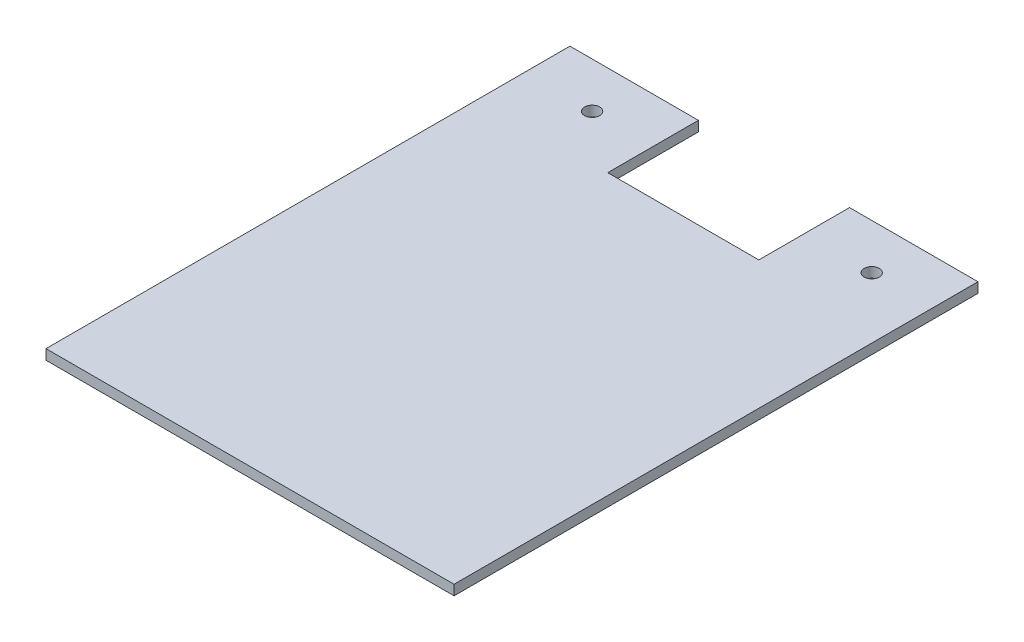
ISO-10303-21;
HEADER;
FILE_DESCRIPTION(('STEP AP214'),'2;1');
FILE_NAME('part.step','',(''),(''),'','','');
FILE_SCHEMA(('AUTOMOTIVE_DESIGN { 1 0 10303 214 1 1 1 1 }'));
ENDSEC;
DATA;
#1=APPLICATION_CONTEXT('core data for automotive mechanical design processes');
#2=APPLICATION_PROTOCOL_DEFINITION('international standard','automotive_design',2000,#1);
#3=PRODUCT_CONTEXT('',#1,'mechanical');
#4=PRODUCT('Part','Part','',(#3));
#5=PRODUCT_RELATED_PRODUCT_CATEGORY('part','',(#4));
#6=PRODUCT_DEFINITION_FORMATION('','',#4);
#7=PRODUCT_DEFINITION_CONTEXT('part definition',#1,'design');
#8=PRODUCT_DEFINITION('design','',#6,#7);
#9=PRODUCT_DEFINITION_SHAPE('','',#8);
#10=(LENGTH_UNIT() NAMED_UNIT(*) SI_UNIT(.MILLI.,.METRE.));
#11=(NAMED_UNIT(*) PLANE_ANGLE_UNIT() SI_UNIT($,.RADIAN.));
#12=(NAMED_UNIT(*) SI_UNIT($,.STERADIAN.) SOLID_ANGLE_UNIT());
#13=UNCERTAINTY_MEASURE_WITH_UNIT(LENGTH_MEASURE(1.E-05),#10,'distance_accuracy_value','');
#14=(GEOMETRIC_REPRESENTATION_CONTEXT(3) GLOBAL_UNCERTAINTY_ASSIGNED_CONTEXT((#13)) GLOBAL_UNIT_ASSIGNED_CONTEXT((#10,
#11,#12)) REPRESENTATION_CONTEXT('',''));
#15=CARTESIAN_POINT('',(0.,0.,0.));
#16=DIRECTION('',(0.,0.,1.));
#17=DIRECTION('',(1.,0.,0.));
#18=AXIS2_PLACEMENT_3D('',#15,#16,#17);
#19=CARTESIAN_POINT('',(-81.,2.,0.));
#20=DIRECTION('',(0.,0.,-1.));
#21=DIRECTION('',(-1.,0.,0.));
#22=AXIS2_PLACEMENT_3D('',#19,#20,#21);
#23=PLANE('',#22);
#24=DIRECTION('',(1.,0.,0.));
#25=VECTOR('',#24,1.);
#26=CARTESIAN_POINT('',(-81.,0.,0.));
#27=LINE('',#26,#25);
#28=CARTESIAN_POINT('',(-81.,0.,0.));
#29=VERTEX_POINT('',#28);
#30=CARTESIAN_POINT('',(0.,0.,0.));
#31=VERTEX_POINT('',#30);
#32=EDGE_CURVE('E140',#29,#31,#27,.T.);
#33=ORIENTED_EDGE('',*,*,#32,.T.);
#34=DIRECTION('',(0.,-1.,0.));
#35=VECTOR('',#34,1.);
#36=CARTESIAN_POINT('',(0.,2.,0.));
#37=LINE('',#36,#35);
#38=CARTESIAN_POINT('',(0.,2.,0.));
#39=VERTEX_POINT('',#38);
#40=EDGE_CURVE('E11',#39,#31,#37,.T.);
#41=ORIENTED_EDGE('',*,*,#40,.F.);
#42=DIRECTION('',(1.,0.,0.));
#43=VECTOR('',#42,1.);
#44=CARTESIAN_POINT('',(-81.,2.,0.));
#45=LINE('',#44,#43);
#46=CARTESIAN_POINT('',(-81.,2.,0.));
#47=VERTEX_POINT('',#46);
#48=EDGE_CURVE('E163',#47,#39,#45,.T.);
#49=ORIENTED_EDGE('',*,*,#48,.F.);
#50=DIRECTION('',(0.,-1.,0.));
#51=VECTOR('',#50,1.);
#52=CARTESIAN_POINT('',(-81.,2.,0.));
#53=LINE('',#52,#51);
#54=EDGE_CURVE('E136',#47,#29,#53,.T.);
#55=ORIENTED_EDGE('',*,*,#54,.T.);
#56=EDGE_LOOP('',(#33,#41,#49,#55));
#57=FACE_BOUND('',#56,.T.);
#58=ADVANCED_FACE('F39',(#57),#23,.F.);
#59=CARTESIAN_POINT('',(0.,2.,0.));
#60=DIRECTION('',(-1.,0.,0.));
#61=DIRECTION('',(0.,0.,1.));
#62=AXIS2_PLACEMENT_3D('',#59,#60,#61);
#63=PLANE('',#62);
#64=DIRECTION('',(0.,0.,-1.));
#65=VECTOR('',#64,1.);
#66=CARTESIAN_POINT('',(0.,0.,0.));
#67=LINE('',#66,#65);
#68=CARTESIAN_POINT('',(0.,0.,-104.));
#69=VERTEX_POINT('',#68);
#70=EDGE_CURVE('E144',#31,#69,#67,.T.);
#71=ORIENTED_EDGE('',*,*,#70,.T.);
#72=DIRECTION('',(0.,-1.,0.));
#73=VECTOR('',#72,1.);
#74=CARTESIAN_POINT('',(0.,2.,-104.));
#75=LINE('',#74,#73);
#76=CARTESIAN_POINT('',(0.,2.,-104.));
#77=VERTEX_POINT('',#76);
#78=EDGE_CURVE('E48',#77,#69,#75,.T.);
#79=ORIENTED_EDGE('',*,*,#78,.F.);
#80=DIRECTION('',(0.,0.,-1.));
#81=VECTOR('',#80,1.);
#82=CARTESIAN_POINT('',(0.,2.,0.));
#83=LINE('',#82,#81);
#84=EDGE_CURVE('E99',#39,#77,#83,.T.);
#85=ORIENTED_EDGE('',*,*,#84,.F.);
#86=ORIENTED_EDGE('',*,*,#40,.T.);
#87=EDGE_LOOP('',(#71,#79,#85,#86));
#88=FACE_BOUND('',#87,.T.);
#89=ADVANCED_FACE('F247',(#88),#63,.F.);
#90=CARTESIAN_POINT('',(0.,2.,-104.));
#91=DIRECTION('',(0.,0.,1.));
#92=DIRECTION('',(1.,0.,0.));
#93=AXIS2_PLACEMENT_3D('',#90,#91,#92);
#94=PLANE('',#93);
#95=DIRECTION('',(-1.,0.,0.));
#96=VECTOR('',#95,1.);
#97=CARTESIAN_POINT('',(0.,0.,-104.));
#98=LINE('',#97,#96);
#99=CARTESIAN_POINT('',(-25.5,0.,-104.));
#100=VERTEX_POINT('',#99);
#101=EDGE_CURVE('E148',#69,#100,#98,.T.);
#102=ORIENTED_EDGE('',*,*,#101,.T.);
#103=DIRECTION('',(0.,-1.,0.));
#104=VECTOR('',#103,1.);
#105=CARTESIAN_POINT('',(-25.5,2.,-104.));
#106=LINE('',#105,#104);
#107=CARTESIAN_POINT('',(-25.5,2.,-104.));
#108=VERTEX_POINT('',#107);
#109=EDGE_CURVE('E174',#108,#100,#106,.T.);
#110=ORIENTED_EDGE('',*,*,#109,.F.);
#111=DIRECTION('',(-1.,0.,0.));
#112=VECTOR('',#111,1.);
#113=CARTESIAN_POINT('',(0.,2.,-104.));
#114=LINE('',#113,#112);
#115=EDGE_CURVE('E184',#77,#108,#114,.T.);
#116=ORIENTED_EDGE('',*,*,#115,.F.);
#117=ORIENTED_EDGE('',*,*,#78,.T.);
#118=EDGE_LOOP('',(#102,#110,#116,#117));
#119=FACE_BOUND('',#118,.T.);
#120=ADVANCED_FACE('F182',(#119),#94,.F.);
#121=CARTESIAN_POINT('',(-25.5,2.,-104.));
#122=DIRECTION('',(1.,0.,0.));
#123=DIRECTION('',(0.,0.,-1.));
#124=AXIS2_PLACEMENT_3D('',#121,#122,#123);
#125=PLANE('',#124);
#126=DIRECTION('',(0.,0.,1.));
#127=VECTOR('',#126,1.);
#128=CARTESIAN_POINT('',(-25.5,0.,-104.));
#129=LINE('',#128,#127);
#130=CARTESIAN_POINT('',(-25.5,0.,-86.));
#131=VERTEX_POINT('',#130);
#132=EDGE_CURVE('E151',#100,#131,#129,.T.);
#133=ORIENTED_EDGE('',*,*,#132,.T.);
#134=DIRECTION('',(0.,-1.,0.));
#135=VECTOR('',#134,1.);
#136=CARTESIAN_POINT('',(-25.5,2.,-86.));
#137=LINE('',#136,#135);
#138=CARTESIAN_POINT('',(-25.5,2.,-86.));
#139=VERTEX_POINT('',#138);
#140=EDGE_CURVE('E170',#139,#131,#137,.T.);
#141=ORIENTED_EDGE('',*,*,#140,.F.);
#142=DIRECTION('',(0.,0.,1.));
#143=VECTOR('',#142,1.);
#144=CARTESIAN_POINT('',(-25.5,2.,-104.));
#145=LINE('',#144,#143);
#146=EDGE_CURVE('E197',#108,#139,#145,.T.);
#147=ORIENTED_EDGE('',*,*,#146,.F.);
#148=ORIENTED_EDGE('',*,*,#109,.T.);
#149=EDGE_LOOP('',(#133,#141,#147,#148));
#150=FACE_BOUND('',#149,.T.);
#151=ADVANCED_FACE('F192',(#150),#125,.F.);
#152=CARTESIAN_POINT('',(-25.5,2.,-86.));
#153=DIRECTION('',(0.,0.,1.));
#154=DIRECTION('',(1.,0.,0.));
#155=AXIS2_PLACEMENT_3D('',#152,#153,#154);
#156=PLANE('',#155);
#157=DIRECTION('',(-1.,0.,0.));
#158=VECTOR('',#157,1.);
#159=CARTESIAN_POINT('',(-25.5,0.,-86.));
#160=LINE('',#159,#158);
#161=CARTESIAN_POINT('',(-55.5,0.,-86.));
#162=VERTEX_POINT('',#161);
#163=EDGE_CURVE('E154',#131,#162,#160,.T.);
#164=ORIENTED_EDGE('',*,*,#163,.T.);
#165=DIRECTION('',(0.,-1.,0.));
#166=VECTOR('',#165,1.);
#167=CARTESIAN_POINT('',(-55.5,2.,-86.));
#168=LINE('',#167,#166);
#169=CARTESIAN_POINT('',(-55.5,2.,-86.));
#170=VERTEX_POINT('',#169);
#171=EDGE_CURVE('E129',#170,#162,#168,.T.);
#172=ORIENTED_EDGE('',*,*,#171,.F.);
#173=DIRECTION('',(-1.,0.,0.));
#174=VECTOR('',#173,1.);
#175=CARTESIAN_POINT('',(-25.5,2.,-86.));
#176=LINE('',#175,#174);
#177=EDGE_CURVE('E118',#139,#170,#176,.T.);
#178=ORIENTED_EDGE('',*,*,#177,.F.);
#179=ORIENTED_EDGE('',*,*,#140,.T.);
#180=EDGE_LOOP('',(#164,#172,#178,#179));
#181=FACE_BOUND('',#180,.T.);
#182=ADVANCED_FACE('F195',(#181),#156,.F.);
#183=CARTESIAN_POINT('',(-55.5,2.,-86.));
#184=DIRECTION('',(-1.,0.,0.));
#185=DIRECTION('',(0.,0.,1.));
#186=AXIS2_PLACEMENT_3D('',#183,#184,#185);
#187=PLANE('',#186);
#188=DIRECTION('',(0.,0.,-1.));
#189=VECTOR('',#188,1.);
#190=CARTESIAN_POINT('',(-55.5,0.,-86.));
#191=LINE('',#190,#189);
#192=CARTESIAN_POINT('',(-55.5,0.,-104.));
#193=VERTEX_POINT('',#192);
#194=EDGE_CURVE('E127',#162,#193,#191,.T.);
#195=ORIENTED_EDGE('',*,*,#194,.T.);
#196=DIRECTION('',(0.,-1.,0.));
#197=VECTOR('',#196,1.);
#198=CARTESIAN_POINT('',(-55.5,2.,-104.));
#199=LINE('',#198,#197);
#200=CARTESIAN_POINT('',(-55.5,2.,-104.));
#201=VERTEX_POINT('',#200);
#202=EDGE_CURVE('E124',#201,#193,#199,.T.);
#203=ORIENTED_EDGE('',*,*,#202,.F.);
#204=DIRECTION('',(0.,0.,-1.));
#205=VECTOR('',#204,1.);
#206=CARTESIAN_POINT('',(-55.5,2.,-86.));
#207=LINE('',#206,#205);
#208=EDGE_CURVE('E112',#170,#201,#207,.T.);
#209=ORIENTED_EDGE('',*,*,#208,.F.);
#210=ORIENTED_EDGE('',*,*,#171,.T.);
#211=EDGE_LOOP('',(#195,#203,#209,#210));
#212=FACE_BOUND('',#211,.T.);
#213=ADVANCED_FACE('F125',(#212),#187,.F.);
#214=CARTESIAN_POINT('',(-55.5,2.,-104.));
#215=DIRECTION('',(0.,0.,1.));
#216=DIRECTION('',(1.,0.,0.));
#217=AXIS2_PLACEMENT_3D('',#214,#215,#216);
#218=PLANE('',#217);
#219=DIRECTION('',(-1.,0.,0.));
#220=VECTOR('',#219,1.);
#221=CARTESIAN_POINT('',(-55.5,0.,-104.));
#222=LINE('',#221,#220);
#223=CARTESIAN_POINT('',(-81.,0.,-104.));
#224=VERTEX_POINT('',#223);
#225=EDGE_CURVE('E85',#193,#224,#222,.T.);
#226=ORIENTED_EDGE('',*,*,#225,.T.);
#227=DIRECTION('',(0.,-1.,0.));
#228=VECTOR('',#227,1.);
#229=CARTESIAN_POINT('',(-81.,2.,-104.));
#230=LINE('',#229,#228);
#231=CARTESIAN_POINT('',(-81.,2.,-104.));
#232=VERTEX_POINT('',#231);
#233=EDGE_CURVE('E130',#232,#224,#230,.T.);
#234=ORIENTED_EDGE('',*,*,#233,.F.);
#235=DIRECTION('',(-1.,0.,0.));
#236=VECTOR('',#235,1.);
#237=CARTESIAN_POINT('',(-55.5,2.,-104.));
#238=LINE('',#237,#236);
#239=EDGE_CURVE('E116',#201,#232,#238,.T.);
#240=ORIENTED_EDGE('',*,*,#239,.F.);
#241=ORIENTED_EDGE('',*,*,#202,.T.);
#242=EDGE_LOOP('',(#226,#234,#240,#241));
#243=FACE_BOUND('',#242,.T.);
#244=ADVANCED_FACE('F132',(#243),#218,.F.);
#245=CARTESIAN_POINT('',(-81.,2.,-104.));
#246=DIRECTION('',(1.,0.,0.));
#247=DIRECTION('',(0.,0.,-1.));
#248=AXIS2_PLACEMENT_3D('',#245,#246,#247);
#249=PLANE('',#248);
#250=DIRECTION('',(0.,0.,1.));
#251=VECTOR('',#250,1.);
#252=CARTESIAN_POINT('',(-81.,0.,-104.));
#253=LINE('',#252,#251);
#254=EDGE_CURVE('E91',#224,#29,#253,.T.);
#255=ORIENTED_EDGE('',*,*,#254,.T.);
#256=ORIENTED_EDGE('',*,*,#54,.F.);
#257=DIRECTION('',(0.,0.,1.));
#258=VECTOR('',#257,1.);
#259=CARTESIAN_POINT('',(-81.,2.,-104.));
#260=LINE('',#259,#258);
#261=EDGE_CURVE('E56',#232,#47,#260,.T.);
#262=ORIENTED_EDGE('',*,*,#261,.F.);
#263=ORIENTED_EDGE('',*,*,#233,.T.);
#264=EDGE_LOOP('',(#255,#256,#262,#263));
#265=FACE_BOUND('',#264,.T.);
#266=ADVANCED_FACE('F234',(#265),#249,.F.);
#267=CARTESIAN_POINT('',(0.,2.,0.));
#268=DIRECTION('',(0.,1.,0.));
#269=DIRECTION('',(0.,0.,1.));
#270=AXIS2_PLACEMENT_3D('',#267,#268,#269);
#271=PLANE('',#270);
#272=CARTESIAN_POINT('',(-67.6,2.,-95.));
#273=DIRECTION('',(0.,1.,0.));
#274=DIRECTION('',(0.,0.,1.));
#275=AXIS2_PLACEMENT_3D('',#272,#273,#274);
#276=CIRCLE('',#275,1.5);
#277=CARTESIAN_POINT('',(-67.6,2.,-93.5));
#278=VERTEX_POINT('',#277);
#279=EDGE_CURVE('E215',#278,#278,#276,.T.);
#280=ORIENTED_EDGE('',*,*,#279,.F.);
#281=EDGE_LOOP('',(#280));
#282=FACE_BOUND('',#281,.T.);
#283=CARTESIAN_POINT('',(-12.1,2.,-95.));
#284=DIRECTION('',(0.,1.,0.));
#285=DIRECTION('',(0.,0.,1.));
#286=AXIS2_PLACEMENT_3D('',#283,#284,#285);
#287=CIRCLE('',#286,1.5);
#288=CARTESIAN_POINT('',(-12.1,2.,-93.5));
#289=VERTEX_POINT('',#288);
#290=EDGE_CURVE('E207',#289,#289,#287,.T.);
#291=ORIENTED_EDGE('',*,*,#290,.F.);
#292=EDGE_LOOP('',(#291));
#293=FACE_BOUND('',#292,.T.);
#294=ORIENTED_EDGE('',*,*,#48,.T.);
#295=ORIENTED_EDGE('',*,*,#84,.T.);
#296=ORIENTED_EDGE('',*,*,#115,.T.);
#297=ORIENTED_EDGE('',*,*,#146,.T.);
#298=ORIENTED_EDGE('',*,*,#177,.T.);
#299=ORIENTED_EDGE('',*,*,#208,.T.);
#300=ORIENTED_EDGE('',*,*,#239,.T.);
#301=ORIENTED_EDGE('',*,*,#261,.T.);
#302=EDGE_LOOP('',(#294,#295,#296,#297,#298,#299,#300,#301));
#303=FACE_BOUND('',#302,.T.);
#304=ADVANCED_FACE('F114',(#282,#293,#303),#271,.T.);
#305=CARTESIAN_POINT('',(0.,0.,0.));
#306=DIRECTION('',(0.,1.,0.));
#307=DIRECTION('',(0.,0.,1.));
#308=AXIS2_PLACEMENT_3D('',#305,#306,#307);
#309=PLANE('',#308);
#310=CARTESIAN_POINT('',(-67.6,0.,-95.));
#311=DIRECTION('',(0.,1.,0.));
#312=DIRECTION('',(0.,0.,1.));
#313=AXIS2_PLACEMENT_3D('',#310,#311,#312);
#314=CIRCLE('',#313,1.5);
#315=CARTESIAN_POINT('',(-67.6,0.,-93.5));
#316=VERTEX_POINT('',#315);
#317=EDGE_CURVE('E145',#316,#316,#314,.T.);
#318=ORIENTED_EDGE('',*,*,#317,.T.);
#319=EDGE_LOOP('',(#318));
#320=FACE_BOUND('',#319,.T.);
#321=CARTESIAN_POINT('',(-12.1,0.,-95.));
#322=DIRECTION('',(0.,1.,0.));
#323=DIRECTION('',(0.,0.,1.));
#324=AXIS2_PLACEMENT_3D('',#321,#322,#323);
#325=CIRCLE('',#324,1.5);
#326=CARTESIAN_POINT('',(-12.1,0.,-93.5));
#327=VERTEX_POINT('',#326);
#328=EDGE_CURVE('E211',#327,#327,#325,.T.);
#329=ORIENTED_EDGE('',*,*,#328,.T.);
#330=EDGE_LOOP('',(#329));
#331=FACE_BOUND('',#330,.T.);
#332=ORIENTED_EDGE('',*,*,#32,.F.);
#333=ORIENTED_EDGE('',*,*,#254,.F.);
#334=ORIENTED_EDGE('',*,*,#225,.F.);
#335=ORIENTED_EDGE('',*,*,#194,.F.);
#336=ORIENTED_EDGE('',*,*,#163,.F.);
#337=ORIENTED_EDGE('',*,*,#132,.F.);
#338=ORIENTED_EDGE('',*,*,#101,.F.);
#339=ORIENTED_EDGE('',*,*,#70,.F.);
#340=EDGE_LOOP('',(#332,#333,#334,#335,#336,#337,#338,#339));
#341=FACE_BOUND('',#340,.T.);
#342=ADVANCED_FACE('F188',(#320,#331,#341),#309,.F.);
#343=CARTESIAN_POINT('',(-12.1,0.,-95.));
#344=DIRECTION('',(0.,1.,0.));
#345=DIRECTION('',(0.,0.,1.));
#346=AXIS2_PLACEMENT_3D('',#343,#344,#345);
#347=CYLINDRICAL_SURFACE('',#346,1.5);
#348=ORIENTED_EDGE('',*,*,#328,.F.);
#349=EDGE_LOOP('',(#348));
#350=FACE_BOUND('',#349,.T.);
#351=ORIENTED_EDGE('',*,*,#290,.T.);
#352=EDGE_LOOP('',(#351));
#353=FACE_BOUND('',#352,.T.);
#354=ADVANCED_FACE('F228',(#350,#353),#347,.F.);
#355=CARTESIAN_POINT('',(-67.6,0.,-95.));
#356=DIRECTION('',(0.,1.,0.));
#357=DIRECTION('',(0.,0.,1.));
#358=AXIS2_PLACEMENT_3D('',#355,#356,#357);
#359=CYLINDRICAL_SURFACE('',#358,1.5);
#360=ORIENTED_EDGE('',*,*,#317,.F.);
#361=EDGE_LOOP('',(#360));
#362=FACE_BOUND('',#361,.T.);
#363=ORIENTED_EDGE('',*,*,#279,.T.);
#364=EDGE_LOOP('',(#363));
#365=FACE_BOUND('',#364,.T.);
#366=ADVANCED_FACE('F225',(#362,#365),#359,.F.);
#367=CLOSED_SHELL('',(#58,#89,#120,#151,#182,#213,#244,#266,#304,#342,#354,#366));
#368=MANIFOLD_SOLID_BREP('B2',#367);
#369=ADVANCED_BREP_SHAPE_REPRESENTATION('',(#18,#368),#14);
#370=SHAPE_DEFINITION_REPRESENTATION(#9,#369);
ENDSEC;
END-ISO-10303-21;
